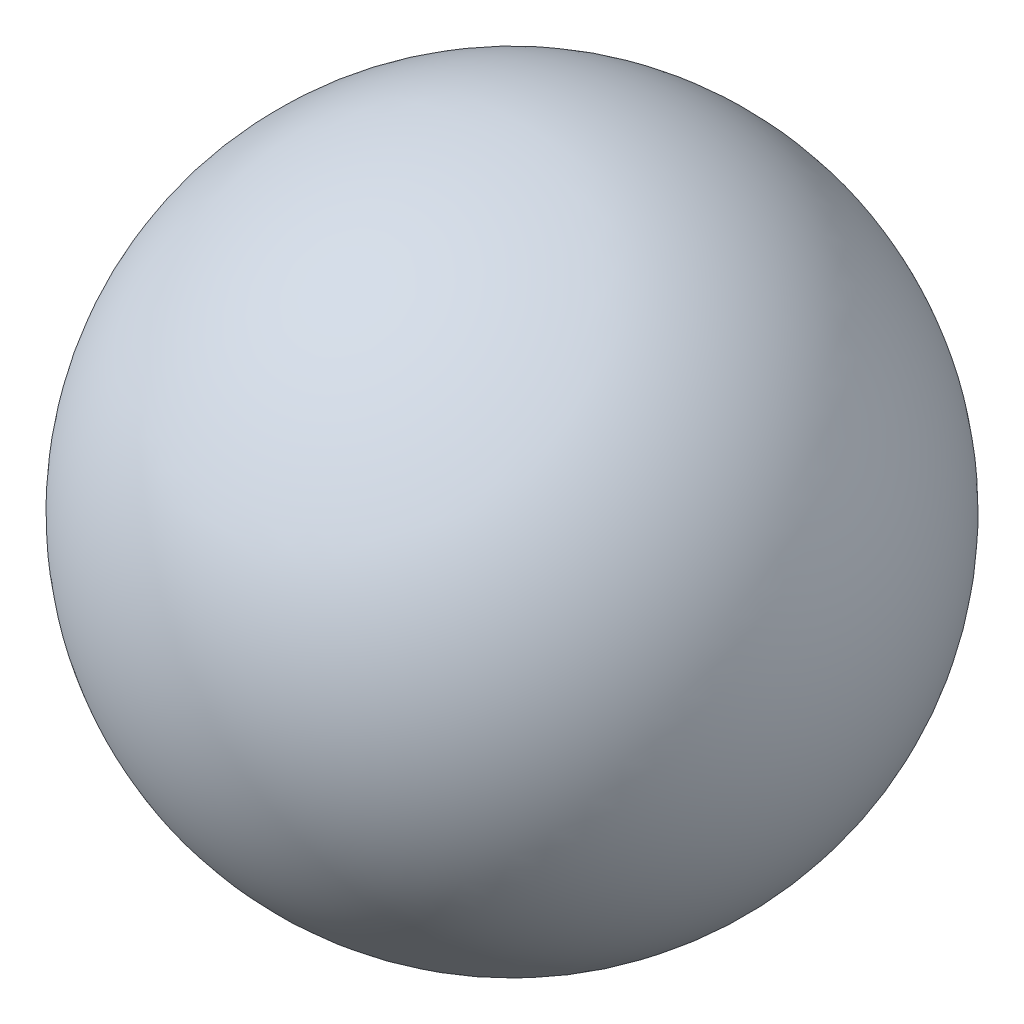
ISO-10303-21;
HEADER;
FILE_DESCRIPTION(('STEP AP214'),'2;1');
FILE_NAME('part.step','',(''),(''),'','','');
FILE_SCHEMA(('AUTOMOTIVE_DESIGN { 1 0 10303 214 1 1 1 1 }'));
ENDSEC;
DATA;
#1=APPLICATION_CONTEXT('core data for automotive mechanical design processes');
#2=APPLICATION_PROTOCOL_DEFINITION('international standard','automotive_design',2000,#1);
#3=PRODUCT_CONTEXT('',#1,'mechanical');
#4=PRODUCT('Part','Part','',(#3));
#5=PRODUCT_RELATED_PRODUCT_CATEGORY('part','',(#4));
#6=PRODUCT_DEFINITION_FORMATION('','',#4);
#7=PRODUCT_DEFINITION_CONTEXT('part definition',#1,'design');
#8=PRODUCT_DEFINITION('design','',#6,#7);
#9=PRODUCT_DEFINITION_SHAPE('','',#8);
#10=(LENGTH_UNIT() NAMED_UNIT(*) SI_UNIT(.MILLI.,.METRE.));
#11=(NAMED_UNIT(*) PLANE_ANGLE_UNIT() SI_UNIT($,.RADIAN.));
#12=(NAMED_UNIT(*) SI_UNIT($,.STERADIAN.) SOLID_ANGLE_UNIT());
#13=UNCERTAINTY_MEASURE_WITH_UNIT(LENGTH_MEASURE(1.E-05),#10,'distance_accuracy_value','');
#14=(GEOMETRIC_REPRESENTATION_CONTEXT(3) GLOBAL_UNCERTAINTY_ASSIGNED_CONTEXT((#13)) GLOBAL_UNIT_ASSIGNED_CONTEXT((#10,
#11,#12)) REPRESENTATION_CONTEXT('',''));
#15=CARTESIAN_POINT('',(0.,0.,0.));
#16=DIRECTION('',(0.,0.,1.));
#17=DIRECTION('',(1.,0.,0.));
#18=AXIS2_PLACEMENT_3D('',#15,#16,#17);
#19=CARTESIAN_POINT('',(10.6881759454156,-2.,4.88112640277219));
#20=DIRECTION('',(0.,0.,1.));
#21=DIRECTION('',(1.,0.,0.));
#22=AXIS2_PLACEMENT_3D('',#19,#20,#21);
#23=SPHERICAL_SURFACE('',#22,1.05);
#24=CARTESIAN_POINT('',(10.6881759454156,-2.,5.93112640277219));
#25=VERTEX_POINT('',#24);
#26=VERTEX_LOOP('',#25);
#27=FACE_BOUND('',#26,.T.);
#28=ADVANCED_FACE('F13',(#27),#23,.T.);
#29=CLOSED_SHELL('',(#28));
#30=MANIFOLD_SOLID_BREP('B1',#29);
#31=ADVANCED_BREP_SHAPE_REPRESENTATION('',(#18,#30),#14);
#32=SHAPE_DEFINITION_REPRESENTATION(#9,#31);
ENDSEC;
END-ISO-10303-21;
